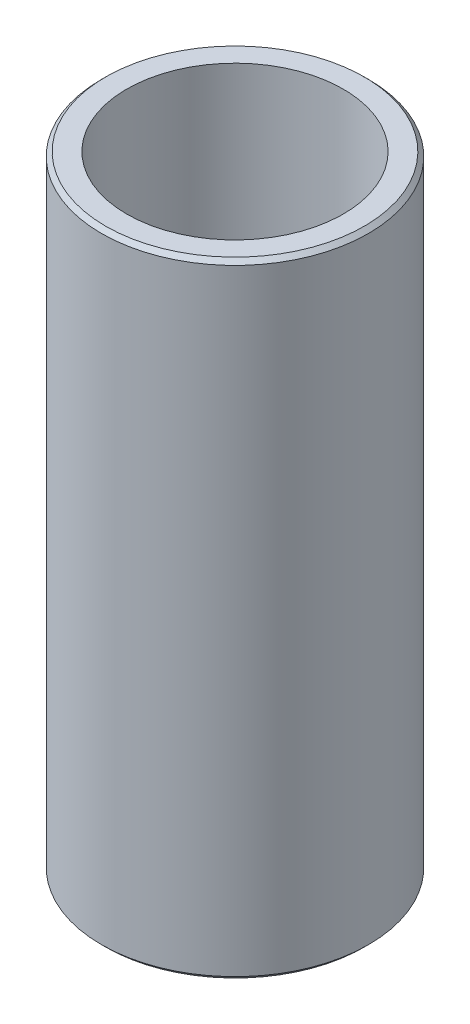
ISO-10303-21;
HEADER;
FILE_DESCRIPTION(('STEP AP214'),'2;1');
FILE_NAME('part.step','',(''),(''),'','','');
FILE_SCHEMA(('AUTOMOTIVE_DESIGN { 1 0 10303 214 1 1 1 1 }'));
ENDSEC;
DATA;
#1=APPLICATION_CONTEXT('core data for automotive mechanical design processes');
#2=APPLICATION_PROTOCOL_DEFINITION('international standard','automotive_design',2000,#1);
#3=PRODUCT_CONTEXT('',#1,'mechanical');
#4=PRODUCT('Part','Part','',(#3));
#5=PRODUCT_RELATED_PRODUCT_CATEGORY('part','',(#4));
#6=PRODUCT_DEFINITION_FORMATION('','',#4);
#7=PRODUCT_DEFINITION_CONTEXT('part definition',#1,'design');
#8=PRODUCT_DEFINITION('design','',#6,#7);
#9=PRODUCT_DEFINITION_SHAPE('','',#8);
#10=(LENGTH_UNIT() NAMED_UNIT(*) SI_UNIT(.MILLI.,.METRE.));
#11=(NAMED_UNIT(*) PLANE_ANGLE_UNIT() SI_UNIT($,.RADIAN.));
#12=(NAMED_UNIT(*) SI_UNIT($,.STERADIAN.) SOLID_ANGLE_UNIT());
#13=UNCERTAINTY_MEASURE_WITH_UNIT(LENGTH_MEASURE(1.E-05),#10,'distance_accuracy_value','');
#14=(GEOMETRIC_REPRESENTATION_CONTEXT(3) GLOBAL_UNCERTAINTY_ASSIGNED_CONTEXT((#13)) GLOBAL_UNIT_ASSIGNED_CONTEXT((#10,
#11,#12)) REPRESENTATION_CONTEXT('',''));
#15=CARTESIAN_POINT('',(0.,0.,0.));
#16=DIRECTION('',(0.,0.,1.));
#17=DIRECTION('',(1.,0.,0.));
#18=AXIS2_PLACEMENT_3D('',#15,#16,#17);
#19=CARTESIAN_POINT('',(0.,37.13,0.));
#20=DIRECTION('',(0.,1.,0.));
#21=DIRECTION('',(0.,0.,1.));
#22=AXIS2_PLACEMENT_3D('',#19,#20,#21);
#23=PLANE('',#22);
#24=CARTESIAN_POINT('',(0.,37.13,0.));
#25=DIRECTION('',(0.,1.,0.));
#26=DIRECTION('',(0.,0.,1.));
#27=AXIS2_PLACEMENT_3D('',#24,#25,#26);
#28=CIRCLE('',#27,7.69);
#29=CARTESIAN_POINT('',(0.,37.13,7.69));
#30=VERTEX_POINT('',#29);
#31=EDGE_CURVE('E10',#30,#30,#28,.T.);
#32=ORIENTED_EDGE('',*,*,#31,.T.);
#33=EDGE_LOOP('',(#32));
#34=FACE_BOUND('',#33,.T.);
#35=CARTESIAN_POINT('',(0.,37.13,0.));
#36=DIRECTION('',(0.,1.,0.));
#37=DIRECTION('',(0.,0.,1.));
#38=AXIS2_PLACEMENT_3D('',#35,#36,#37);
#39=CIRCLE('',#38,6.44);
#40=CARTESIAN_POINT('',(0.,37.13,6.44));
#41=VERTEX_POINT('',#40);
#42=EDGE_CURVE('E51',#41,#41,#39,.T.);
#43=ORIENTED_EDGE('',*,*,#42,.F.);
#44=EDGE_LOOP('',(#43));
#45=FACE_BOUND('',#44,.T.);
#46=ADVANCED_FACE('F31',(#34,#45),#23,.T.);
#47=CARTESIAN_POINT('',(0.,0.,0.));
#48=DIRECTION('',(0.,1.,0.));
#49=DIRECTION('',(0.,0.,1.));
#50=AXIS2_PLACEMENT_3D('',#47,#48,#49);
#51=PLANE('',#50);
#52=CARTESIAN_POINT('',(0.,0.,0.));
#53=DIRECTION('',(0.,1.,0.));
#54=DIRECTION('',(0.,0.,1.));
#55=AXIS2_PLACEMENT_3D('',#52,#53,#54);
#56=CIRCLE('',#55,7.69000000000001);
#57=CARTESIAN_POINT('',(0.,0.,7.69000000000001));
#58=VERTEX_POINT('',#57);
#59=EDGE_CURVE('E38',#58,#58,#56,.F.);
#60=ORIENTED_EDGE('',*,*,#59,.T.);
#61=EDGE_LOOP('',(#60));
#62=FACE_BOUND('',#61,.T.);
#63=CARTESIAN_POINT('',(0.,0.,0.));
#64=DIRECTION('',(0.,1.,0.));
#65=DIRECTION('',(0.,0.,1.));
#66=AXIS2_PLACEMENT_3D('',#63,#64,#65);
#67=CIRCLE('',#66,6.44);
#68=CARTESIAN_POINT('',(0.,0.,6.44));
#69=VERTEX_POINT('',#68);
#70=EDGE_CURVE('E52',#69,#69,#67,.T.);
#71=ORIENTED_EDGE('',*,*,#70,.T.);
#72=EDGE_LOOP('',(#71));
#73=FACE_BOUND('',#72,.T.);
#74=ADVANCED_FACE('F62',(#62,#73),#51,.F.);
#75=CARTESIAN_POINT('',(0.,37.13,0.));
#76=DIRECTION('',(0.,-1.,0.));
#77=DIRECTION('',(0.,0.,-1.));
#78=AXIS2_PLACEMENT_3D('',#75,#76,#77);
#79=CYLINDRICAL_SURFACE('',#78,7.94);
#80=CARTESIAN_POINT('',(0.,0.249999999999993,0.));
#81=DIRECTION('',(0.,1.,0.));
#82=DIRECTION('',(0.,0.,1.));
#83=AXIS2_PLACEMENT_3D('',#80,#81,#82);
#84=CIRCLE('',#83,7.94);
#85=CARTESIAN_POINT('',(0.,0.249999999999993,7.94));
#86=VERTEX_POINT('',#85);
#87=EDGE_CURVE('E42',#86,#86,#84,.T.);
#88=ORIENTED_EDGE('',*,*,#87,.T.);
#89=EDGE_LOOP('',(#88));
#90=FACE_BOUND('',#89,.T.);
#91=CARTESIAN_POINT('',(0.,36.88,0.));
#92=DIRECTION('',(0.,1.,0.));
#93=DIRECTION('',(0.,0.,1.));
#94=AXIS2_PLACEMENT_3D('',#91,#92,#93);
#95=CIRCLE('',#94,7.94);
#96=CARTESIAN_POINT('',(0.,36.88,7.94));
#97=VERTEX_POINT('',#96);
#98=EDGE_CURVE('E46',#97,#97,#95,.F.);
#99=ORIENTED_EDGE('',*,*,#98,.T.);
#100=EDGE_LOOP('',(#99));
#101=FACE_BOUND('',#100,.T.);
#102=ADVANCED_FACE('F67',(#90,#101),#79,.T.);
#103=CARTESIAN_POINT('',(0.,37.13,0.));
#104=DIRECTION('',(0.,-1.,0.));
#105=DIRECTION('',(0.,0.,-1.));
#106=AXIS2_PLACEMENT_3D('',#103,#104,#105);
#107=CYLINDRICAL_SURFACE('',#106,6.44);
#108=ORIENTED_EDGE('',*,*,#42,.T.);
#109=EDGE_LOOP('',(#108));
#110=FACE_BOUND('',#109,.T.);
#111=ORIENTED_EDGE('',*,*,#70,.F.);
#112=EDGE_LOOP('',(#111));
#113=FACE_BOUND('',#112,.T.);
#114=ADVANCED_FACE('F58',(#110,#113),#107,.F.);
#115=CARTESIAN_POINT('',(0.,0.249999999999993,0.));
#116=DIRECTION('',(0.,1.,0.));
#117=DIRECTION('',(0.,0.,1.));
#118=AXIS2_PLACEMENT_3D('',#115,#116,#117);
#119=CONICAL_SURFACE('',#118,7.94,0.785398163397445);
#120=ORIENTED_EDGE('',*,*,#59,.F.);
#121=EDGE_LOOP('',(#120));
#122=FACE_BOUND('',#121,.T.);
#123=ORIENTED_EDGE('',*,*,#87,.F.);
#124=EDGE_LOOP('',(#123));
#125=FACE_BOUND('',#124,.T.);
#126=ADVANCED_FACE('F73',(#122,#125),#119,.T.);
#127=CARTESIAN_POINT('',(0.,37.13,0.));
#128=DIRECTION('',(0.,-1.,0.));
#129=DIRECTION('',(0.,0.,-1.));
#130=AXIS2_PLACEMENT_3D('',#127,#128,#129);
#131=CONICAL_SURFACE('',#130,7.69,0.785398163397417);
#132=ORIENTED_EDGE('',*,*,#98,.F.);
#133=EDGE_LOOP('',(#132));
#134=FACE_BOUND('',#133,.T.);
#135=ORIENTED_EDGE('',*,*,#31,.F.);
#136=EDGE_LOOP('',(#135));
#137=FACE_BOUND('',#136,.T.);
#138=ADVANCED_FACE('F33',(#134,#137),#131,.T.);
#139=CLOSED_SHELL('',(#46,#74,#102,#114,#126,#138));
#140=MANIFOLD_SOLID_BREP('B2',#139);
#141=ADVANCED_BREP_SHAPE_REPRESENTATION('',(#18,#140),#14);
#142=SHAPE_DEFINITION_REPRESENTATION(#9,#141);
ENDSEC;
END-ISO-10303-21;
